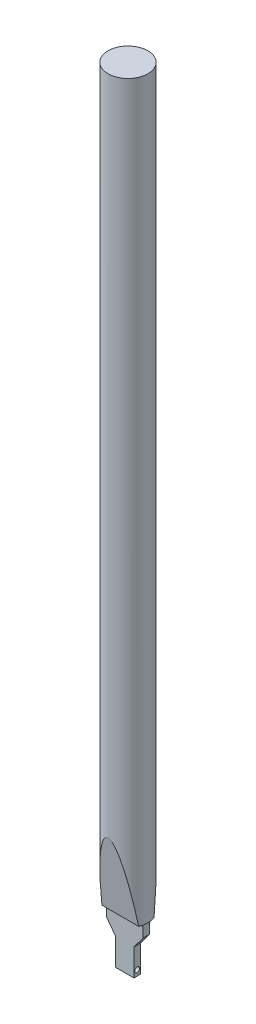
ISO-10303-21;
HEADER;
FILE_DESCRIPTION(('STEP AP214'),'2;1');
FILE_NAME('part.step','',(''),(''),'','','');
FILE_SCHEMA(('AUTOMOTIVE_DESIGN { 1 0 10303 214 1 1 1 1 }'));
ENDSEC;
DATA;
#1=APPLICATION_CONTEXT('core data for automotive mechanical design processes');
#2=APPLICATION_PROTOCOL_DEFINITION('international standard','automotive_design',2000,#1);
#3=PRODUCT_CONTEXT('',#1,'mechanical');
#4=PRODUCT('Part','Part','',(#3));
#5=PRODUCT_RELATED_PRODUCT_CATEGORY('part','',(#4));
#6=PRODUCT_DEFINITION_FORMATION('','',#4);
#7=PRODUCT_DEFINITION_CONTEXT('part definition',#1,'design');
#8=PRODUCT_DEFINITION('design','',#6,#7);
#9=PRODUCT_DEFINITION_SHAPE('','',#8);
#10=(LENGTH_UNIT() NAMED_UNIT(*) SI_UNIT(.MILLI.,.METRE.));
#11=(NAMED_UNIT(*) PLANE_ANGLE_UNIT() SI_UNIT($,.RADIAN.));
#12=(NAMED_UNIT(*) SI_UNIT($,.STERADIAN.) SOLID_ANGLE_UNIT());
#13=UNCERTAINTY_MEASURE_WITH_UNIT(LENGTH_MEASURE(1.E-05),#10,'distance_accuracy_value','');
#14=(GEOMETRIC_REPRESENTATION_CONTEXT(3) GLOBAL_UNCERTAINTY_ASSIGNED_CONTEXT((#13)) GLOBAL_UNIT_ASSIGNED_CONTEXT((#10,
#11,#12)) REPRESENTATION_CONTEXT('',''));
#15=CARTESIAN_POINT('',(0.,0.,0.));
#16=DIRECTION('',(0.,0.,1.));
#17=DIRECTION('',(1.,0.,0.));
#18=AXIS2_PLACEMENT_3D('',#15,#16,#17);
#19=CARTESIAN_POINT('',(1.5,2.4,-0.525));
#20=DIRECTION('',(-1.,0.,0.));
#21=DIRECTION('',(0.,0.,1.));
#22=AXIS2_PLACEMENT_3D('',#19,#20,#21);
#23=PLANE('',#22);
#24=CARTESIAN_POINT('',(1.5,0.9,0.));
#25=DIRECTION('',(1.,0.,0.));
#26=DIRECTION('',(0.,0.,-1.));
#27=AXIS2_PLACEMENT_3D('',#24,#25,#26);
#28=CIRCLE('',#27,0.4);
#29=CARTESIAN_POINT('',(1.5,0.9,-0.400000000000001));
#30=VERTEX_POINT('',#29);
#31=EDGE_CURVE('E266',#30,#30,#28,.T.);
#32=ORIENTED_EDGE('',*,*,#31,.F.);
#33=EDGE_LOOP('',(#32));
#34=FACE_BOUND('',#33,.T.);
#35=DIRECTION('',(0.,0.,-1.));
#36=VECTOR('',#35,1.);
#37=CARTESIAN_POINT('',(1.5,0.,-0.525));
#38=LINE('',#37,#36);
#39=CARTESIAN_POINT('',(1.5,0.,0.525));
#40=VERTEX_POINT('',#39);
#41=CARTESIAN_POINT('',(1.5,0.,-0.525));
#42=VERTEX_POINT('',#41);
#43=EDGE_CURVE('E272',#40,#42,#38,.T.);
#44=ORIENTED_EDGE('',*,*,#43,.T.);
#45=DIRECTION('',(0.,-1.,0.));
#46=VECTOR('',#45,1.);
#47=CARTESIAN_POINT('',(1.5,2.4,-0.525));
#48=LINE('',#47,#46);
#49=CARTESIAN_POINT('',(1.5,4.4,-0.524999999999999));
#50=VERTEX_POINT('',#49);
#51=EDGE_CURVE('E228',#50,#42,#48,.T.);
#52=ORIENTED_EDGE('',*,*,#51,.F.);
#53=DIRECTION('',(0.,0.,1.));
#54=VECTOR('',#53,1.);
#55=CARTESIAN_POINT('',(1.5,4.4,-9.01028137423857));
#56=LINE('',#55,#54);
#57=CARTESIAN_POINT('',(1.5,4.4,0.525));
#58=VERTEX_POINT('',#57);
#59=EDGE_CURVE('E246',#50,#58,#56,.T.);
#60=ORIENTED_EDGE('',*,*,#59,.T.);
#61=DIRECTION('',(0.,-1.,0.));
#62=VECTOR('',#61,1.);
#63=CARTESIAN_POINT('',(1.5,2.4,0.525));
#64=LINE('',#63,#62);
#65=EDGE_CURVE('E281',#58,#40,#64,.T.);
#66=ORIENTED_EDGE('',*,*,#65,.T.);
#67=EDGE_LOOP('',(#44,#52,#60,#66));
#68=FACE_BOUND('',#67,.T.);
#69=ADVANCED_FACE('F38',(#34,#68),#23,.F.);
#70=CARTESIAN_POINT('',(-1.5,2.4,-0.525));
#71=DIRECTION('',(0.,0.,1.));
#72=DIRECTION('',(1.,0.,0.));
#73=AXIS2_PLACEMENT_3D('',#70,#71,#72);
#74=PLANE('',#73);
#75=DIRECTION('',(0.,1.,0.));
#76=VECTOR('',#75,1.);
#77=CARTESIAN_POINT('',(-3.,0.,-0.524999999999999));
#78=LINE('',#77,#76);
#79=CARTESIAN_POINT('',(-3.,6.4,-0.524999999999999));
#80=VERTEX_POINT('',#79);
#81=CARTESIAN_POINT('',(-3.,7.9,-0.524999999999999));
#82=VERTEX_POINT('',#81);
#83=EDGE_CURVE('E153',#80,#82,#78,.T.);
#84=ORIENTED_EDGE('',*,*,#83,.T.);
#85=DIRECTION('',(-1.,0.,0.));
#86=VECTOR('',#85,1.);
#87=CARTESIAN_POINT('',(3.,7.9,-0.525));
#88=LINE('',#87,#86);
#89=CARTESIAN_POINT('',(3.,7.9,-0.524999999999999));
#90=VERTEX_POINT('',#89);
#91=EDGE_CURVE('E211',#82,#90,#88,.F.);
#92=ORIENTED_EDGE('',*,*,#91,.T.);
#93=DIRECTION('',(0.,1.,0.));
#94=VECTOR('',#93,1.);
#95=CARTESIAN_POINT('',(3.,0.,-0.524999999999999));
#96=LINE('',#95,#94);
#97=CARTESIAN_POINT('',(3.,6.4,-0.524999999999999));
#98=VERTEX_POINT('',#97);
#99=EDGE_CURVE('E223',#98,#90,#96,.T.);
#100=ORIENTED_EDGE('',*,*,#99,.F.);
#101=DIRECTION('',(0.600000000000001,0.799999999999999,0.));
#102=VECTOR('',#101,1.);
#103=CARTESIAN_POINT('',(-1.152,0.864000000000003,-0.524999999999999));
#104=LINE('',#103,#102);
#105=EDGE_CURVE('E244',#50,#98,#104,.T.);
#106=ORIENTED_EDGE('',*,*,#105,.F.);
#107=ORIENTED_EDGE('',*,*,#51,.T.);
#108=DIRECTION('',(-1.,0.,0.));
#109=VECTOR('',#108,1.);
#110=CARTESIAN_POINT('',(-1.5,0.,-0.525));
#111=LINE('',#110,#109);
#112=CARTESIAN_POINT('',(-1.5,0.,-0.525));
#113=VERTEX_POINT('',#112);
#114=EDGE_CURVE('E275',#42,#113,#111,.T.);
#115=ORIENTED_EDGE('',*,*,#114,.T.);
#116=DIRECTION('',(0.,-1.,0.));
#117=VECTOR('',#116,1.);
#118=CARTESIAN_POINT('',(-1.5,2.4,-0.525));
#119=LINE('',#118,#117);
#120=CARTESIAN_POINT('',(-1.5,4.4,-0.524999999999999));
#121=VERTEX_POINT('',#120);
#122=EDGE_CURVE('E232',#121,#113,#119,.T.);
#123=ORIENTED_EDGE('',*,*,#122,.F.);
#124=DIRECTION('',(-0.599999999999999,0.800000000000001,0.));
#125=VECTOR('',#124,1.);
#126=CARTESIAN_POINT('',(1.152,0.863999999999995,-0.524999999999999));
#127=LINE('',#126,#125);
#128=EDGE_CURVE('E240',#121,#80,#127,.T.);
#129=ORIENTED_EDGE('',*,*,#128,.T.);
#130=EDGE_LOOP('',(#84,#92,#100,#106,#107,#115,#123,#129));
#131=FACE_BOUND('',#130,.T.);
#132=ADVANCED_FACE('F178',(#131),#74,.F.);
#133=CARTESIAN_POINT('',(-1.5,2.4,-0.525));
#134=DIRECTION('',(1.,0.,0.));
#135=DIRECTION('',(0.,0.,-1.));
#136=AXIS2_PLACEMENT_3D('',#133,#134,#135);
#137=PLANE('',#136);
#138=CARTESIAN_POINT('',(-1.5,0.9,0.));
#139=DIRECTION('',(1.,0.,0.));
#140=DIRECTION('',(0.,0.,-1.));
#141=AXIS2_PLACEMENT_3D('',#138,#139,#140);
#142=CIRCLE('',#141,0.4);
#143=CARTESIAN_POINT('',(-1.5,0.9,-0.4));
#144=VERTEX_POINT('',#143);
#145=EDGE_CURVE('E269',#144,#144,#142,.F.);
#146=ORIENTED_EDGE('',*,*,#145,.F.);
#147=EDGE_LOOP('',(#146));
#148=FACE_BOUND('',#147,.T.);
#149=DIRECTION('',(0.,0.,1.));
#150=VECTOR('',#149,1.);
#151=CARTESIAN_POINT('',(-1.5,0.,-0.525));
#152=LINE('',#151,#150);
#153=CARTESIAN_POINT('',(-1.5,0.,0.525));
#154=VERTEX_POINT('',#153);
#155=EDGE_CURVE('E277',#113,#154,#152,.T.);
#156=ORIENTED_EDGE('',*,*,#155,.T.);
#157=DIRECTION('',(0.,-1.,0.));
#158=VECTOR('',#157,1.);
#159=CARTESIAN_POINT('',(-1.5,2.4,0.525));
#160=LINE('',#159,#158);
#161=CARTESIAN_POINT('',(-1.5,4.4,0.525));
#162=VERTEX_POINT('',#161);
#163=EDGE_CURVE('E284',#162,#154,#160,.T.);
#164=ORIENTED_EDGE('',*,*,#163,.F.);
#165=DIRECTION('',(0.,0.,1.));
#166=VECTOR('',#165,1.);
#167=CARTESIAN_POINT('',(-1.5,4.4,-9.01028137423857));
#168=LINE('',#167,#166);
#169=EDGE_CURVE('E253',#121,#162,#168,.T.);
#170=ORIENTED_EDGE('',*,*,#169,.F.);
#171=ORIENTED_EDGE('',*,*,#122,.T.);
#172=EDGE_LOOP('',(#156,#164,#170,#171));
#173=FACE_BOUND('',#172,.T.);
#174=ADVANCED_FACE('F184',(#148,#173),#137,.F.);
#175=CARTESIAN_POINT('',(-1.5,2.4,0.525));
#176=DIRECTION('',(0.,0.,-1.));
#177=DIRECTION('',(-1.,0.,0.));
#178=AXIS2_PLACEMENT_3D('',#175,#176,#177);
#179=PLANE('',#178);
#180=DIRECTION('',(0.,-1.,0.));
#181=VECTOR('',#180,1.);
#182=CARTESIAN_POINT('',(3.,0.,0.525));
#183=LINE('',#182,#181);
#184=CARTESIAN_POINT('',(3.,7.9,0.525));
#185=VERTEX_POINT('',#184);
#186=CARTESIAN_POINT('',(3.,6.4,0.525));
#187=VERTEX_POINT('',#186);
#188=EDGE_CURVE('E152',#185,#187,#183,.T.);
#189=ORIENTED_EDGE('',*,*,#188,.F.);
#190=DIRECTION('',(1.,0.,0.));
#191=VECTOR('',#190,1.);
#192=CARTESIAN_POINT('',(-3.,7.9,0.525));
#193=LINE('',#192,#191);
#194=CARTESIAN_POINT('',(-3.,7.9,0.525));
#195=VERTEX_POINT('',#194);
#196=EDGE_CURVE('E202',#185,#195,#193,.F.);
#197=ORIENTED_EDGE('',*,*,#196,.T.);
#198=DIRECTION('',(0.,-1.,0.));
#199=VECTOR('',#198,1.);
#200=CARTESIAN_POINT('',(-3.,0.,0.525));
#201=LINE('',#200,#199);
#202=CARTESIAN_POINT('',(-3.,6.4,0.525));
#203=VERTEX_POINT('',#202);
#204=EDGE_CURVE('E301',#195,#203,#201,.T.);
#205=ORIENTED_EDGE('',*,*,#204,.T.);
#206=DIRECTION('',(0.599999999999999,-0.800000000000001,0.));
#207=VECTOR('',#206,1.);
#208=CARTESIAN_POINT('',(1.152,0.863999999999995,0.525));
#209=LINE('',#208,#207);
#210=EDGE_CURVE('E300',#203,#162,#209,.T.);
#211=ORIENTED_EDGE('',*,*,#210,.T.);
#212=ORIENTED_EDGE('',*,*,#163,.T.);
#213=DIRECTION('',(1.,0.,0.));
#214=VECTOR('',#213,1.);
#215=CARTESIAN_POINT('',(-1.5,0.,0.525));
#216=LINE('',#215,#214);
#217=EDGE_CURVE('E279',#154,#40,#216,.T.);
#218=ORIENTED_EDGE('',*,*,#217,.T.);
#219=ORIENTED_EDGE('',*,*,#65,.F.);
#220=DIRECTION('',(-0.600000000000001,-0.799999999999999,0.));
#221=VECTOR('',#220,1.);
#222=CARTESIAN_POINT('',(-1.152,0.864000000000003,0.525));
#223=LINE('',#222,#221);
#224=EDGE_CURVE('E256',#187,#58,#223,.T.);
#225=ORIENTED_EDGE('',*,*,#224,.F.);
#226=EDGE_LOOP('',(#189,#197,#205,#211,#212,#218,#219,#225));
#227=FACE_BOUND('',#226,.T.);
#228=ADVANCED_FACE('F296',(#227),#179,.F.);
#229=CARTESIAN_POINT('',(0.,0.,0.));
#230=DIRECTION('',(0.,1.,0.));
#231=DIRECTION('',(0.,0.,1.));
#232=AXIS2_PLACEMENT_3D('',#229,#230,#231);
#233=PLANE('',#232);
#234=CARTESIAN_POINT('',(0.,0.,0.));
#235=DIRECTION('',(0.,-1.,0.));
#236=DIRECTION('',(0.,0.,-1.));
#237=AXIS2_PLACEMENT_3D('',#234,#235,#236);
#238=CIRCLE('',#237,0.25);
#239=CARTESIAN_POINT('',(0.,0.,-0.25));
#240=VERTEX_POINT('',#239);
#241=EDGE_CURVE('E141',#240,#240,#238,.T.);
#242=ORIENTED_EDGE('',*,*,#241,.F.);
#243=EDGE_LOOP('',(#242));
#244=FACE_BOUND('',#243,.T.);
#245=ORIENTED_EDGE('',*,*,#43,.F.);
#246=ORIENTED_EDGE('',*,*,#217,.F.);
#247=ORIENTED_EDGE('',*,*,#155,.F.);
#248=ORIENTED_EDGE('',*,*,#114,.F.);
#249=EDGE_LOOP('',(#245,#246,#247,#248));
#250=FACE_BOUND('',#249,.T.);
#251=ADVANCED_FACE('F293',(#244,#250),#233,.F.);
#252=CARTESIAN_POINT('',(-2.63137084989848,0.9,0.));
#253=DIRECTION('',(1.,0.,0.));
#254=DIRECTION('',(0.,0.,-1.));
#255=AXIS2_PLACEMENT_3D('',#252,#253,#254);
#256=CYLINDRICAL_SURFACE('',#255,0.4);
#257=CARTESIAN_POINT('',(0.,0.58775010008008,-0.25));
#258=CARTESIAN_POINT('',(-0.0124240563593021,0.587748399848508,-0.249998924422359));
#259=CARTESIAN_POINT('',(-0.0248675670650716,0.586994714537741,-0.249065387709045));
#260=CARTESIAN_POINT('',(-0.0493352640248795,0.58411256563375,-0.245397901656128));
#261=CARTESIAN_POINT('',(-0.0613582173078217,0.581980367244428,-0.242659060823483));
#262=CARTESIAN_POINT('',(-0.0845564645003003,0.57669982917187,-0.235576147862563));
#263=CARTESIAN_POINT('',(-0.0957381215982307,0.573560324528782,-0.231245986808291));
#264=CARTESIAN_POINT('',(-0.117201772190415,0.566634097929845,-0.221143891267116));
#265=CARTESIAN_POINT('',(-0.127483741133545,0.562847358320259,-0.215371917451889));
#266=CARTESIAN_POINT('',(-0.148373030941465,0.554440777456127,-0.201647875809562));
#267=CARTESIAN_POINT('',(-0.158838948178914,0.549777323600614,-0.19350721872581));
#268=CARTESIAN_POINT('',(-0.178376539816587,0.540494358234892,-0.175661732912078));
#269=CARTESIAN_POINT('',(-0.187446999453286,0.535874888257733,-0.165955556263064));
#270=CARTESIAN_POINT('',(-0.205020717033545,0.526541092235472,-0.143837333047685));
#271=CARTESIAN_POINT('',(-0.213323533621907,0.521882555521767,-0.13124011378104));
#272=CARTESIAN_POINT('',(-0.227625040951587,0.513633536597057,-0.104480814168533));
#273=CARTESIAN_POINT('',(-0.233626013149985,0.510041997639138,-0.0903203012959205));
#274=CARTESIAN_POINT('',(-0.242496462121651,0.504660317364664,-0.062355375672159));
#275=CARTESIAN_POINT('',(-0.24562228327945,0.502724155156205,-0.0486611272093829));
#276=CARTESIAN_POINT('',(-0.249526413928617,0.500298911241315,-0.0208210201325179));
#277=CARTESIAN_POINT('',(-0.250307191224096,0.499808308312625,-0.00667565211282209));
#278=CARTESIAN_POINT('',(-0.24952886214449,0.500294181784997,0.0196131656842825));
#279=CARTESIAN_POINT('',(-0.248269724739818,0.501082600376181,0.0317705046547624));
#280=CARTESIAN_POINT('',(-0.244026603127337,0.503709455477564,0.0556613291807287));
#281=CARTESIAN_POINT('',(-0.241042488552512,0.505547971349875,0.0673947826293887));
#282=CARTESIAN_POINT('',(-0.233479244980561,0.510123732770539,0.0901778234154208));
#283=CARTESIAN_POINT('',(-0.22889603519022,0.512863276651748,0.101225575098666));
#284=CARTESIAN_POINT('',(-0.218306248948064,0.519028734221766,0.122403844093857));
#285=CARTESIAN_POINT('',(-0.212299348222113,0.522454804253148,0.132534151711928));
#286=CARTESIAN_POINT('',(-0.198194366933864,0.530213550496613,0.152942703113489));
#287=CARTESIAN_POINT('',(-0.189929074650499,0.534605991378603,0.163082468984109));
#288=CARTESIAN_POINT('',(-0.171973523956362,0.543609074502644,0.18191971918078));
#289=CARTESIAN_POINT('',(-0.162281194714576,0.548220027128348,0.190615067756729));
#290=CARTESIAN_POINT('',(-0.140258875414386,0.557857115745433,0.207470891787216));
#291=CARTESIAN_POINT('',(-0.127749723812545,0.562858836814127,0.215413230965251));
#292=CARTESIAN_POINT('',(-0.101270776062677,0.571971721928463,0.229052306401269));
#293=CARTESIAN_POINT('',(-0.0873037312739264,0.576084520063182,0.23475317918669));
#294=CARTESIAN_POINT('',(-0.062046119389931,0.581816246533168,0.242437133716402));
#295=CARTESIAN_POINT('',(-0.0510178073471866,0.583806590305248,0.245003683484425));
#296=CARTESIAN_POINT('',(-0.0285769621195238,0.58664172118927,0.248620337116108));
#297=CARTESIAN_POINT('',(-0.0171649757485204,0.587488073240646,0.249672512717083));
#298=CARTESIAN_POINT('',(0.00574573608265901,0.587907733225154,0.250197071898875));
#299=CARTESIAN_POINT('',(0.01724460026636,0.587478123795614,0.249665835150436));
#300=CARTESIAN_POINT('',(0.0399561162131294,0.585407914198043,0.247051467114694));
#301=CARTESIAN_POINT('',(0.0511685229943955,0.583766311170325,0.244967050641247));
#302=CARTESIAN_POINT('',(0.0728436767713794,0.579539878816111,0.239409871448949));
#303=CARTESIAN_POINT('',(0.0833157346658223,0.576971044131055,0.235960561253385));
#304=CARTESIAN_POINT('',(0.103557466911876,0.571168853112917,0.227804903877237));
#305=CARTESIAN_POINT('',(0.113326890405038,0.56793526101862,0.223098110542898));
#306=CARTESIAN_POINT('',(0.133861207835241,0.560425592023987,0.211530753544573));
#307=CARTESIAN_POINT('',(0.14446150824982,0.556068248523922,0.204430747628424));
#308=CARTESIAN_POINT('',(0.164437010487874,0.547212083998076,0.18873805264499));
#309=CARTESIAN_POINT('',(0.173810923395605,0.542713120193148,0.180143814899325));
#310=CARTESIAN_POINT('',(0.192596649248616,0.533233671962222,0.160076131899833));
#311=CARTESIAN_POINT('',(0.201773711401531,0.52829159042485,0.148361989942831));
#312=CARTESIAN_POINT('',(0.218013730375175,0.519231502069957,0.123259997573917));
#313=CARTESIAN_POINT('',(0.225077677994729,0.515113109341723,0.109872935749733));
#314=CARTESIAN_POINT('',(0.236398998240527,0.508381488084888,0.0825851801273197));
#315=CARTESIAN_POINT('',(0.240798841294152,0.505693030821643,0.0687629645089039));
#316=CARTESIAN_POINT('',(0.247145333736217,0.501785979823918,0.0403721997769495));
#317=CARTESIAN_POINT('',(0.249095377952222,0.500565352133993,0.0258047126476735));
#318=CARTESIAN_POINT('',(0.250309304007757,0.499806628502883,-0.00131981439936244));
#319=CARTESIAN_POINT('',(0.249927155357397,0.500046798752766,-0.0138562595190948));
#320=CARTESIAN_POINT('',(0.247307665005133,0.501678520082455,-0.0386559622183451));
#321=CARTESIAN_POINT('',(0.245070407484846,0.503070018916963,-0.0509192321681486));
#322=CARTESIAN_POINT('',(0.238967905024681,0.50680779062204,-0.0744086589371052));
#323=CARTESIAN_POINT('',(0.23516183202536,0.509119265056598,-0.0856560361356618));
#324=CARTESIAN_POINT('',(0.226088014367187,0.51451006264547,-0.107342873822263));
#325=CARTESIAN_POINT('',(0.220820023104882,0.517589515337189,-0.117782197623648));
#326=CARTESIAN_POINT('',(0.208367884201759,0.52464931552035,-0.138731347494133));
#327=CARTESIAN_POINT('',(0.201041603736204,0.528689995066087,-0.149136025432443));
#328=CARTESIAN_POINT('',(0.18498467393346,0.537132719087525,-0.168643321671082));
#329=CARTESIAN_POINT('',(0.176252439950811,0.541535168538763,-0.177744448611045));
#330=CARTESIAN_POINT('',(0.156176747539347,0.550999169800946,-0.195744720260162));
#331=CARTESIAN_POINT('',(0.14463833096462,0.556064257107355,-0.204425659747636));
#332=CARTESIAN_POINT('',(0.120071066797973,0.565650357005944,-0.219754650011484));
#333=CARTESIAN_POINT('',(0.107043049018467,0.570171669665963,-0.226403825114185));
#334=CARTESIAN_POINT('',(0.0827194464140769,0.577140447839521,-0.236198221846473));
#335=CARTESIAN_POINT('',(0.0716728638241624,0.579825319300521,-0.2397924325528));
#336=CARTESIAN_POINT('',(0.0490061444085267,0.584121683124294,-0.245425644360777));
#337=CARTESIAN_POINT('',(0.0373879489950429,0.585736571200288,-0.24746956849067));
#338=CARTESIAN_POINT('',(0.0213938952274762,0.58704708722098,-0.249119812366245));
#339=CARTESIAN_POINT('',(0.0171271708967246,0.587309860905738,-0.249449342519294));
#340=CARTESIAN_POINT('',(0.00857440669558038,0.587661682610515,-0.249889649468444));
#341=CARTESIAN_POINT('',(0.00428836223922002,0.587750686942266,-0.250000371252867));
#342=CARTESIAN_POINT('',(0.,0.58775010008008,-0.25));
#343=B_SPLINE_CURVE_WITH_KNOTS('',3,(#257,#258,#259,#260,#261,#262,#263,#264,#265,#266,#267,
#268,#269,#270,#271,#272,#273,#274,#275,#276,#277,#278,#279,#280,#281,#282,#283,#284,#285,#286,
#287,#288,#289,#290,#291,#292,#293,#294,#295,#296,#297,#298,#299,#300,#301,#302,#303,#304,#305,
#306,#307,#308,#309,#310,#311,#312,#313,#314,#315,#316,#317,#318,#319,#320,#321,#322,#323,#324,
#325,#326,#327,#328,#329,#330,#331,#332,#333,#334,#335,#336,#337,#338,#339,#340,#341,#342),
.UNSPECIFIED.,.T.,.F.,(4,2,2,2,2,2,2,2,2,2,2,2,2,2,2,2,2,2,2,2,2,2,2,2,2,2,2,2,2,2,2,2,2,2,2,2,
2,2,2,2,2,2,4),(0.,0.0372524888024028,0.0746063308794191,0.111641111210076,0.148676901848709,
0.190681241461173,0.232721941968981,0.279834472042072,0.326900185451679,0.369180825603955,
0.411416956157933,0.447984639140181,0.484555086125986,0.521219549625071,0.557892372229501,
0.599129009637373,0.64042608800553,0.687116135814801,0.733719610163713,0.768065550884284,
0.80236445988388,0.83674185035078,0.871147718189463,0.904986424556498,0.938837152843572,
0.979132667089558,1.01947019683981,1.06627319719108,1.11305421799255,1.1570401608584,
1.20096508238722,1.23840720291955,1.27584762448647,1.31198913809815,1.34813675194506,
1.38803628808679,1.42798111378704,1.4736836347118,1.51936081904007,1.55499380441013,
1.59051315579607,1.6033682180083,1.61622651176335),.UNSPECIFIED.);
#344=CARTESIAN_POINT('',(0.,0.58775010008008,-0.25));
#345=VERTEX_POINT('',#344);
#346=EDGE_CURVE('E144',#345,#345,#343,.T.);
#347=ORIENTED_EDGE('',*,*,#346,.F.);
#348=EDGE_LOOP('',(#347));
#349=FACE_BOUND('',#348,.T.);
#350=ORIENTED_EDGE('',*,*,#145,.T.);
#351=EDGE_LOOP('',(#350));
#352=FACE_BOUND('',#351,.T.);
#353=ORIENTED_EDGE('',*,*,#31,.T.);
#354=EDGE_LOOP('',(#353));
#355=FACE_BOUND('',#354,.T.);
#356=ADVANCED_FACE('F316',(#349,#352,#355),#256,.F.);
#357=CARTESIAN_POINT('',(-3.,0.,-9.01028137423857));
#358=DIRECTION('',(-1.,0.,0.));
#359=DIRECTION('',(0.,-1.,0.));
#360=AXIS2_PLACEMENT_3D('',#357,#358,#359);
#361=PLANE('',#360);
#362=ORIENTED_EDGE('',*,*,#83,.F.);
#363=DIRECTION('',(0.,0.,1.));
#364=VECTOR('',#363,1.);
#365=CARTESIAN_POINT('',(-3.,6.4,-9.01028137423857));
#366=LINE('',#365,#364);
#367=EDGE_CURVE('E261',#80,#203,#366,.T.);
#368=ORIENTED_EDGE('',*,*,#367,.T.);
#369=ORIENTED_EDGE('',*,*,#204,.F.);
#370=CARTESIAN_POINT('',(-3.,7.9,1.025));
#371=DIRECTION('',(-1.,0.,0.));
#372=DIRECTION('',(0.,-1.,0.));
#373=AXIS2_PLACEMENT_3D('',#370,#371,#372);
#374=CIRCLE('',#373,0.5);
#375=CARTESIAN_POINT('',(-3.,8.4,1.025));
#376=VERTEX_POINT('',#375);
#377=EDGE_CURVE('E200',#195,#376,#374,.F.);
#378=ORIENTED_EDGE('',*,*,#377,.T.);
#379=DIRECTION('',(0.,0.,1.));
#380=VECTOR('',#379,1.);
#381=CARTESIAN_POINT('',(-3.,8.4,-9.01028137423857));
#382=LINE('',#381,#380);
#383=CARTESIAN_POINT('',(-3.,8.4,-1.025));
#384=VERTEX_POINT('',#383);
#385=EDGE_CURVE('E263',#384,#376,#382,.T.);
#386=ORIENTED_EDGE('',*,*,#385,.F.);
#387=CARTESIAN_POINT('',(-3.,7.9,-1.025));
#388=DIRECTION('',(-1.,0.,0.));
#389=DIRECTION('',(0.,-1.,0.));
#390=AXIS2_PLACEMENT_3D('',#387,#388,#389);
#391=CIRCLE('',#390,0.5);
#392=EDGE_CURVE('E207',#384,#82,#391,.F.);
#393=ORIENTED_EDGE('',*,*,#392,.T.);
#394=EDGE_LOOP('',(#362,#368,#369,#378,#386,#393));
#395=FACE_BOUND('',#394,.T.);
#396=ADVANCED_FACE('F307',(#395),#361,.T.);
#397=CARTESIAN_POINT('',(1.152,0.863999999999995,-9.01028137423857));
#398=DIRECTION('',(-0.800000000000001,-0.599999999999999,0.));
#399=DIRECTION('',(0.599999999999999,-0.800000000000001,0.));
#400=AXIS2_PLACEMENT_3D('',#397,#398,#399);
#401=PLANE('',#400);
#402=ORIENTED_EDGE('',*,*,#128,.F.);
#403=ORIENTED_EDGE('',*,*,#169,.T.);
#404=ORIENTED_EDGE('',*,*,#210,.F.);
#405=ORIENTED_EDGE('',*,*,#367,.F.);
#406=EDGE_LOOP('',(#402,#403,#404,#405));
#407=FACE_BOUND('',#406,.T.);
#408=ADVANCED_FACE('F309',(#407),#401,.T.);
#409=CARTESIAN_POINT('',(-1.152,0.864000000000003,-9.01028137423857));
#410=DIRECTION('',(-0.799999999999999,0.600000000000001,0.));
#411=DIRECTION('',(-0.600000000000001,-0.799999999999999,0.));
#412=AXIS2_PLACEMENT_3D('',#409,#410,#411);
#413=PLANE('',#412);
#414=ORIENTED_EDGE('',*,*,#59,.F.);
#415=ORIENTED_EDGE('',*,*,#105,.T.);
#416=DIRECTION('',(0.,0.,1.));
#417=VECTOR('',#416,1.);
#418=CARTESIAN_POINT('',(3.,6.4,-9.01028137423857));
#419=LINE('',#418,#417);
#420=EDGE_CURVE('E243',#98,#187,#419,.T.);
#421=ORIENTED_EDGE('',*,*,#420,.T.);
#422=ORIENTED_EDGE('',*,*,#224,.T.);
#423=EDGE_LOOP('',(#414,#415,#421,#422));
#424=FACE_BOUND('',#423,.T.);
#425=ADVANCED_FACE('F299',(#424),#413,.F.);
#426=CARTESIAN_POINT('',(3.,0.,-9.01028137423857));
#427=DIRECTION('',(-1.,0.,0.));
#428=DIRECTION('',(0.,-1.,0.));
#429=AXIS2_PLACEMENT_3D('',#426,#427,#428);
#430=PLANE('',#429);
#431=ORIENTED_EDGE('',*,*,#420,.F.);
#432=ORIENTED_EDGE('',*,*,#99,.T.);
#433=CARTESIAN_POINT('',(3.,7.9,-1.025));
#434=DIRECTION('',(-1.,0.,0.));
#435=DIRECTION('',(0.,-1.,0.));
#436=AXIS2_PLACEMENT_3D('',#433,#434,#435);
#437=CIRCLE('',#436,0.5);
#438=CARTESIAN_POINT('',(3.,8.4,-1.025));
#439=VERTEX_POINT('',#438);
#440=EDGE_CURVE('E134',#90,#439,#437,.T.);
#441=ORIENTED_EDGE('',*,*,#440,.T.);
#442=DIRECTION('',(0.,0.,1.));
#443=VECTOR('',#442,1.);
#444=CARTESIAN_POINT('',(3.,8.4,-9.01028137423857));
#445=LINE('',#444,#443);
#446=CARTESIAN_POINT('',(3.,8.4,1.025));
#447=VERTEX_POINT('',#446);
#448=EDGE_CURVE('E222',#439,#447,#445,.T.);
#449=ORIENTED_EDGE('',*,*,#448,.T.);
#450=CARTESIAN_POINT('',(3.,7.9,1.025));
#451=DIRECTION('',(-1.,0.,0.));
#452=DIRECTION('',(0.,-1.,0.));
#453=AXIS2_PLACEMENT_3D('',#450,#451,#452);
#454=CIRCLE('',#453,0.5);
#455=EDGE_CURVE('E208',#447,#185,#454,.T.);
#456=ORIENTED_EDGE('',*,*,#455,.T.);
#457=ORIENTED_EDGE('',*,*,#188,.T.);
#458=EDGE_LOOP('',(#431,#432,#441,#449,#456,#457));
#459=FACE_BOUND('',#458,.T.);
#460=ADVANCED_FACE('F221',(#459),#430,.F.);
#461=CARTESIAN_POINT('',(0.,8.401,0.));
#462=DIRECTION('',(0.,-1.,0.));
#463=DIRECTION('',(0.,0.,-1.));
#464=AXIS2_PLACEMENT_3D('',#461,#462,#463);
#465=CYLINDRICAL_SURFACE('',#464,0.25);
#466=ORIENTED_EDGE('',*,*,#346,.T.);
#467=EDGE_LOOP('',(#466));
#468=FACE_BOUND('',#467,.T.);
#469=ORIENTED_EDGE('',*,*,#241,.T.);
#470=EDGE_LOOP('',(#469));
#471=FACE_BOUND('',#470,.T.);
#472=ADVANCED_FACE('F155',(#468,#471),#465,.F.);
#473=CARTESIAN_POINT('',(0.,128.4,0.));
#474=DIRECTION('',(0.,-1.,0.));
#475=DIRECTION('',(0.,0.,-1.));
#476=AXIS2_PLACEMENT_3D('',#473,#474,#475);
#477=CYLINDRICAL_SURFACE('',#476,3.25);
#478=CARTESIAN_POINT('',(0.,128.4,0.));
#479=DIRECTION('',(0.,1.,0.));
#480=DIRECTION('',(0.,0.,1.));
#481=AXIS2_PLACEMENT_3D('',#478,#479,#480);
#482=CIRCLE('',#481,3.25);
#483=CARTESIAN_POINT('',(0.,128.4,3.25));
#484=VERTEX_POINT('',#483);
#485=EDGE_CURVE('E137',#484,#484,#482,.T.);
#486=ORIENTED_EDGE('',*,*,#485,.F.);
#487=EDGE_LOOP('',(#486));
#488=FACE_BOUND('',#487,.T.);
#489=CARTESIAN_POINT('',(0.,8.4,0.));
#490=DIRECTION('',(0.,1.,0.));
#491=DIRECTION('',(0.,0.,1.));
#492=AXIS2_PLACEMENT_3D('',#489,#490,#491);
#493=CIRCLE('',#492,3.25);
#494=CARTESIAN_POINT('',(-3.,8.4,-1.25));
#495=VERTEX_POINT('',#494);
#496=CARTESIAN_POINT('',(-3.,8.4,1.25));
#497=VERTEX_POINT('',#496);
#498=EDGE_CURVE('E128',#495,#497,#493,.T.);
#499=ORIENTED_EDGE('',*,*,#498,.T.);
#500=CARTESIAN_POINT('',(0.,0.899999999999984,0.));
#501=DIRECTION('',(0.,0.164398987305357,-0.986393923832144));
#502=DIRECTION('',(0.,-0.986393923832144,-0.164398987305357));
#503=AXIS2_PLACEMENT_3D('',#500,#501,#502);
#504=ELLIPSE('',#503,19.7689782234692,3.25);
#505=CARTESIAN_POINT('',(3.,8.4,1.25));
#506=VERTEX_POINT('',#505);
#507=EDGE_CURVE('E52',#497,#506,#504,.T.);
#508=ORIENTED_EDGE('',*,*,#507,.T.);
#509=CARTESIAN_POINT('',(3.,8.4,-1.25));
#510=VERTEX_POINT('',#509);
#511=EDGE_CURVE('E130',#506,#510,#493,.T.);
#512=ORIENTED_EDGE('',*,*,#511,.T.);
#513=CARTESIAN_POINT('',(0.,0.899999999999984,0.));
#514=DIRECTION('',(0.,0.164398987305357,0.986393923832144));
#515=DIRECTION('',(0.,-0.986393923832144,0.164398987305357));
#516=AXIS2_PLACEMENT_3D('',#513,#514,#515);
#517=ELLIPSE('',#516,19.7689782234692,3.25);
#518=EDGE_CURVE('E58',#510,#495,#517,.T.);
#519=ORIENTED_EDGE('',*,*,#518,.T.);
#520=EDGE_LOOP('',(#499,#508,#512,#519));
#521=FACE_BOUND('',#520,.T.);
#522=ADVANCED_FACE('F126',(#488,#521),#477,.T.);
#523=CARTESIAN_POINT('',(0.,128.4,0.));
#524=DIRECTION('',(0.,1.,0.));
#525=DIRECTION('',(0.,0.,1.));
#526=AXIS2_PLACEMENT_3D('',#523,#524,#525);
#527=PLANE('',#526);
#528=ORIENTED_EDGE('',*,*,#485,.T.);
#529=EDGE_LOOP('',(#528));
#530=FACE_BOUND('',#529,.T.);
#531=ADVANCED_FACE('F162',(#530),#527,.T.);
#532=CARTESIAN_POINT('',(0.,8.4,0.));
#533=DIRECTION('',(0.,1.,0.));
#534=DIRECTION('',(0.,0.,1.));
#535=AXIS2_PLACEMENT_3D('',#532,#533,#534);
#536=PLANE('',#535);
#537=DIRECTION('',(1.,0.,0.));
#538=VECTOR('',#537,1.);
#539=CARTESIAN_POINT('',(3.,8.4,1.025));
#540=LINE('',#539,#538);
#541=EDGE_CURVE('E204',#376,#447,#540,.T.);
#542=ORIENTED_EDGE('',*,*,#541,.T.);
#543=ORIENTED_EDGE('',*,*,#448,.F.);
#544=DIRECTION('',(-1.,0.,0.));
#545=VECTOR('',#544,1.);
#546=CARTESIAN_POINT('',(-3.,8.4,-1.025));
#547=LINE('',#546,#545);
#548=EDGE_CURVE('E227',#439,#384,#547,.T.);
#549=ORIENTED_EDGE('',*,*,#548,.T.);
#550=ORIENTED_EDGE('',*,*,#385,.T.);
#551=EDGE_LOOP('',(#542,#543,#549,#550));
#552=FACE_BOUND('',#551,.T.);
#553=ORIENTED_EDGE('',*,*,#511,.F.);
#554=DIRECTION('',(-1.,0.,0.));
#555=VECTOR('',#554,1.);
#556=CARTESIAN_POINT('',(0.,8.4,1.25));
#557=LINE('',#556,#555);
#558=EDGE_CURVE('E11',#506,#497,#557,.T.);
#559=ORIENTED_EDGE('',*,*,#558,.T.);
#560=ORIENTED_EDGE('',*,*,#498,.F.);
#561=DIRECTION('',(1.,0.,0.));
#562=VECTOR('',#561,1.);
#563=CARTESIAN_POINT('',(0.,8.4,-1.25));
#564=LINE('',#563,#562);
#565=EDGE_CURVE('E46',#495,#510,#564,.T.);
#566=ORIENTED_EDGE('',*,*,#565,.T.);
#567=EDGE_LOOP('',(#553,#559,#560,#566));
#568=FACE_BOUND('',#567,.T.);
#569=ADVANCED_FACE('F135',(#552,#568),#536,.F.);
#570=CARTESIAN_POINT('',(0.,7.9,1.025));
#571=DIRECTION('',(-1.,0.,0.));
#572=DIRECTION('',(0.,0.,1.));
#573=AXIS2_PLACEMENT_3D('',#570,#571,#572);
#574=CYLINDRICAL_SURFACE('',#573,0.5);
#575=ORIENTED_EDGE('',*,*,#377,.F.);
#576=ORIENTED_EDGE('',*,*,#196,.F.);
#577=ORIENTED_EDGE('',*,*,#455,.F.);
#578=ORIENTED_EDGE('',*,*,#541,.F.);
#579=EDGE_LOOP('',(#575,#576,#577,#578));
#580=FACE_BOUND('',#579,.T.);
#581=ADVANCED_FACE('F166',(#580),#574,.F.);
#582=CARTESIAN_POINT('',(0.,7.9,-1.025));
#583=DIRECTION('',(1.,0.,0.));
#584=DIRECTION('',(0.,0.,-1.));
#585=AXIS2_PLACEMENT_3D('',#582,#583,#584);
#586=CYLINDRICAL_SURFACE('',#585,0.5);
#587=ORIENTED_EDGE('',*,*,#440,.F.);
#588=ORIENTED_EDGE('',*,*,#91,.F.);
#589=ORIENTED_EDGE('',*,*,#392,.F.);
#590=ORIENTED_EDGE('',*,*,#548,.F.);
#591=EDGE_LOOP('',(#587,#588,#589,#590));
#592=FACE_BOUND('',#591,.T.);
#593=ADVANCED_FACE('F40',(#592),#586,.F.);
#594=CARTESIAN_POINT('',(-3.25,20.4,-3.25));
#595=DIRECTION('',(0.,0.164398987305357,0.986393923832144));
#596=DIRECTION('',(0.,-0.986393923832144,0.164398987305357));
#597=AXIS2_PLACEMENT_3D('',#594,#595,#596);
#598=PLANE('',#597);
#599=ORIENTED_EDGE('',*,*,#565,.F.);
#600=ORIENTED_EDGE('',*,*,#518,.F.);
#601=EDGE_LOOP('',(#599,#600));
#602=FACE_BOUND('',#601,.T.);
#603=ADVANCED_FACE('F132',(#602),#598,.F.);
#604=CARTESIAN_POINT('',(-3.25,20.4,3.25));
#605=DIRECTION('',(0.,0.164398987305357,-0.986393923832144));
#606=DIRECTION('',(0.,0.986393923832144,0.164398987305357));
#607=AXIS2_PLACEMENT_3D('',#604,#605,#606);
#608=PLANE('',#607);
#609=ORIENTED_EDGE('',*,*,#558,.F.);
#610=ORIENTED_EDGE('',*,*,#507,.F.);
#611=EDGE_LOOP('',(#609,#610));
#612=FACE_BOUND('',#611,.T.);
#613=ADVANCED_FACE('F173',(#612),#608,.F.);
#614=CLOSED_SHELL('',(#69,#132,#174,#228,#251,#356,#396,#408,#425,#460,#472,#522,#531,#569,#581,
#593,#603,#613));
#615=MANIFOLD_SOLID_BREP('B2',#614);
#616=ADVANCED_BREP_SHAPE_REPRESENTATION('',(#18,#615),#14);
#617=SHAPE_DEFINITION_REPRESENTATION(#9,#616);
ENDSEC;
END-ISO-10303-21;
